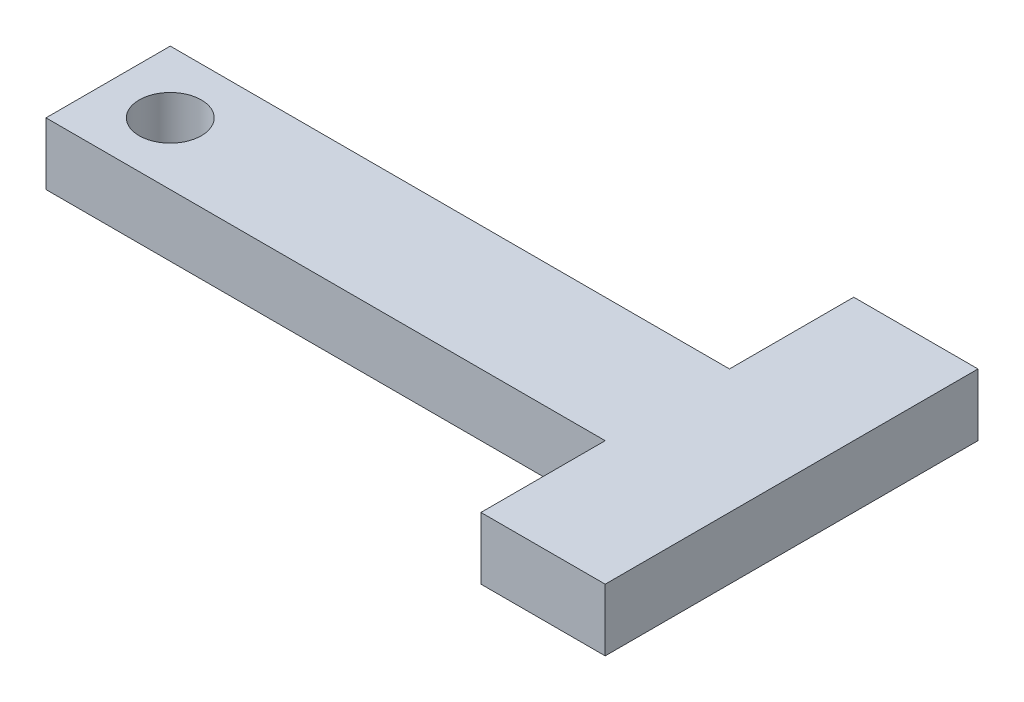
ISO-10303-21;
HEADER;
FILE_DESCRIPTION(('STEP AP214'),'2;1');
FILE_NAME('part.step','',(''),(''),'','','');
FILE_SCHEMA(('AUTOMOTIVE_DESIGN { 1 0 10303 214 1 1 1 1 }'));
ENDSEC;
DATA;
#1=APPLICATION_CONTEXT('core data for automotive mechanical design processes');
#2=APPLICATION_PROTOCOL_DEFINITION('international standard','automotive_design',2000,#1);
#3=PRODUCT_CONTEXT('',#1,'mechanical');
#4=PRODUCT('Part','Part','',(#3));
#5=PRODUCT_RELATED_PRODUCT_CATEGORY('part','',(#4));
#6=PRODUCT_DEFINITION_FORMATION('','',#4);
#7=PRODUCT_DEFINITION_CONTEXT('part definition',#1,'design');
#8=PRODUCT_DEFINITION('design','',#6,#7);
#9=PRODUCT_DEFINITION_SHAPE('','',#8);
#10=(LENGTH_UNIT() NAMED_UNIT(*) SI_UNIT(.MILLI.,.METRE.));
#11=(NAMED_UNIT(*) PLANE_ANGLE_UNIT() SI_UNIT($,.RADIAN.));
#12=(NAMED_UNIT(*) SI_UNIT($,.STERADIAN.) SOLID_ANGLE_UNIT());
#13=UNCERTAINTY_MEASURE_WITH_UNIT(LENGTH_MEASURE(1.E-05),#10,'distance_accuracy_value','');
#14=(GEOMETRIC_REPRESENTATION_CONTEXT(3) GLOBAL_UNCERTAINTY_ASSIGNED_CONTEXT((#13)) GLOBAL_UNIT_ASSIGNED_CONTEXT((#10,
#11,#12)) REPRESENTATION_CONTEXT('',''));
#15=CARTESIAN_POINT('',(0.,0.,0.));
#16=DIRECTION('',(0.,0.,1.));
#17=DIRECTION('',(1.,0.,0.));
#18=AXIS2_PLACEMENT_3D('',#15,#16,#17);
#19=CARTESIAN_POINT('',(0.,10.,0.));
#20=DIRECTION('',(0.,-1.,0.));
#21=DIRECTION('',(0.,0.,-1.));
#22=AXIS2_PLACEMENT_3D('',#19,#20,#21);
#23=PLANE('',#22);
#24=DIRECTION('',(0.,0.,1.));
#25=VECTOR('',#24,1.);
#26=CARTESIAN_POINT('',(0.,10.,0.));
#27=LINE('',#26,#25);
#28=CARTESIAN_POINT('',(0.,10.,-20.));
#29=VERTEX_POINT('',#28);
#30=CARTESIAN_POINT('',(0.,10.,0.));
#31=VERTEX_POINT('',#30);
#32=EDGE_CURVE('E145',#29,#31,#27,.T.);
#33=ORIENTED_EDGE('',*,*,#32,.T.);
#34=DIRECTION('',(1.,0.,0.));
#35=VECTOR('',#34,1.);
#36=CARTESIAN_POINT('',(0.,10.,0.));
#37=LINE('',#36,#35);
#38=CARTESIAN_POINT('',(90.,10.,0.));
#39=VERTEX_POINT('',#38);
#40=EDGE_CURVE('E93',#31,#39,#37,.T.);
#41=ORIENTED_EDGE('',*,*,#40,.T.);
#42=DIRECTION('',(0.,0.,1.));
#43=VECTOR('',#42,1.);
#44=CARTESIAN_POINT('',(90.,10.,20.));
#45=LINE('',#44,#43);
#46=CARTESIAN_POINT('',(90.,10.,20.));
#47=VERTEX_POINT('',#46);
#48=EDGE_CURVE('E160',#39,#47,#45,.T.);
#49=ORIENTED_EDGE('',*,*,#48,.T.);
#50=DIRECTION('',(1.,0.,0.));
#51=VECTOR('',#50,1.);
#52=CARTESIAN_POINT('',(110.,10.,20.));
#53=LINE('',#52,#51);
#54=CARTESIAN_POINT('',(110.,10.,20.));
#55=VERTEX_POINT('',#54);
#56=EDGE_CURVE('E173',#47,#55,#53,.T.);
#57=ORIENTED_EDGE('',*,*,#56,.T.);
#58=DIRECTION('',(0.,0.,-1.));
#59=VECTOR('',#58,1.);
#60=CARTESIAN_POINT('',(110.,10.,-40.));
#61=LINE('',#60,#59);
#62=CARTESIAN_POINT('',(110.,10.,-40.));
#63=VERTEX_POINT('',#62);
#64=EDGE_CURVE('E112',#55,#63,#61,.T.);
#65=ORIENTED_EDGE('',*,*,#64,.T.);
#66=DIRECTION('',(-1.,0.,0.));
#67=VECTOR('',#66,1.);
#68=CARTESIAN_POINT('',(90.,10.,-40.));
#69=LINE('',#68,#67);
#70=CARTESIAN_POINT('',(90.,10.,-40.));
#71=VERTEX_POINT('',#70);
#72=EDGE_CURVE('E106',#63,#71,#69,.T.);
#73=ORIENTED_EDGE('',*,*,#72,.T.);
#74=DIRECTION('',(0.,0.,1.));
#75=VECTOR('',#74,1.);
#76=CARTESIAN_POINT('',(90.,10.,-20.));
#77=LINE('',#76,#75);
#78=CARTESIAN_POINT('',(90.,10.,-20.));
#79=VERTEX_POINT('',#78);
#80=EDGE_CURVE('E110',#71,#79,#77,.T.);
#81=ORIENTED_EDGE('',*,*,#80,.T.);
#82=DIRECTION('',(-1.,0.,0.));
#83=VECTOR('',#82,1.);
#84=CARTESIAN_POINT('',(0.,10.,-20.));
#85=LINE('',#84,#83);
#86=EDGE_CURVE('E50',#79,#29,#85,.T.);
#87=ORIENTED_EDGE('',*,*,#86,.T.);
#88=EDGE_LOOP('',(#33,#41,#49,#57,#65,#73,#81,#87));
#89=FACE_BOUND('',#88,.T.);
#90=CARTESIAN_POINT('',(10.,10.,-10.));
#91=DIRECTION('',(0.,1.,0.));
#92=DIRECTION('',(0.,0.,1.));
#93=AXIS2_PLACEMENT_3D('',#90,#91,#92);
#94=CIRCLE('',#93,5.);
#95=CARTESIAN_POINT('',(10.,10.,-5.));
#96=VERTEX_POINT('',#95);
#97=EDGE_CURVE('E134',#96,#96,#94,.T.);
#98=ORIENTED_EDGE('',*,*,#97,.F.);
#99=EDGE_LOOP('',(#98));
#100=FACE_BOUND('',#99,.T.);
#101=ADVANCED_FACE('F33',(#89,#100),#23,.F.);
#102=CARTESIAN_POINT('',(0.,0.,0.));
#103=DIRECTION('',(0.,-1.,0.));
#104=DIRECTION('',(0.,0.,-1.));
#105=AXIS2_PLACEMENT_3D('',#102,#103,#104);
#106=PLANE('',#105);
#107=DIRECTION('',(0.,0.,1.));
#108=VECTOR('',#107,1.);
#109=CARTESIAN_POINT('',(0.,0.,0.));
#110=LINE('',#109,#108);
#111=CARTESIAN_POINT('',(0.,0.,-20.));
#112=VERTEX_POINT('',#111);
#113=CARTESIAN_POINT('',(0.,0.,0.));
#114=VERTEX_POINT('',#113);
#115=EDGE_CURVE('E130',#112,#114,#110,.T.);
#116=ORIENTED_EDGE('',*,*,#115,.F.);
#117=DIRECTION('',(-1.,0.,0.));
#118=VECTOR('',#117,1.);
#119=CARTESIAN_POINT('',(0.,0.,-20.));
#120=LINE('',#119,#118);
#121=CARTESIAN_POINT('',(90.,0.,-20.));
#122=VERTEX_POINT('',#121);
#123=EDGE_CURVE('E85',#122,#112,#120,.T.);
#124=ORIENTED_EDGE('',*,*,#123,.F.);
#125=DIRECTION('',(0.,0.,1.));
#126=VECTOR('',#125,1.);
#127=CARTESIAN_POINT('',(90.,0.,-20.));
#128=LINE('',#127,#126);
#129=CARTESIAN_POINT('',(90.,0.,-40.));
#130=VERTEX_POINT('',#129);
#131=EDGE_CURVE('E79',#130,#122,#128,.T.);
#132=ORIENTED_EDGE('',*,*,#131,.F.);
#133=DIRECTION('',(-1.,0.,0.));
#134=VECTOR('',#133,1.);
#135=CARTESIAN_POINT('',(90.,0.,-40.));
#136=LINE('',#135,#134);
#137=CARTESIAN_POINT('',(110.,0.,-40.));
#138=VERTEX_POINT('',#137);
#139=EDGE_CURVE('E120',#138,#130,#136,.T.);
#140=ORIENTED_EDGE('',*,*,#139,.F.);
#141=DIRECTION('',(0.,0.,-1.));
#142=VECTOR('',#141,1.);
#143=CARTESIAN_POINT('',(110.,0.,-40.));
#144=LINE('',#143,#142);
#145=CARTESIAN_POINT('',(110.,0.,20.));
#146=VERTEX_POINT('',#145);
#147=EDGE_CURVE('E140',#146,#138,#144,.T.);
#148=ORIENTED_EDGE('',*,*,#147,.F.);
#149=DIRECTION('',(1.,0.,0.));
#150=VECTOR('',#149,1.);
#151=CARTESIAN_POINT('',(110.,0.,20.));
#152=LINE('',#151,#150);
#153=CARTESIAN_POINT('',(90.,0.,20.));
#154=VERTEX_POINT('',#153);
#155=EDGE_CURVE('E138',#154,#146,#152,.T.);
#156=ORIENTED_EDGE('',*,*,#155,.F.);
#157=DIRECTION('',(0.,0.,1.));
#158=VECTOR('',#157,1.);
#159=CARTESIAN_POINT('',(90.,0.,20.));
#160=LINE('',#159,#158);
#161=CARTESIAN_POINT('',(90.,0.,0.));
#162=VERTEX_POINT('',#161);
#163=EDGE_CURVE('E136',#162,#154,#160,.T.);
#164=ORIENTED_EDGE('',*,*,#163,.F.);
#165=DIRECTION('',(1.,0.,0.));
#166=VECTOR('',#165,1.);
#167=CARTESIAN_POINT('',(0.,0.,0.));
#168=LINE('',#167,#166);
#169=EDGE_CURVE('E133',#114,#162,#168,.T.);
#170=ORIENTED_EDGE('',*,*,#169,.F.);
#171=EDGE_LOOP('',(#116,#124,#132,#140,#148,#156,#164,#170));
#172=FACE_BOUND('',#171,.T.);
#173=CARTESIAN_POINT('',(10.,0.,-10.));
#174=DIRECTION('',(0.,1.,0.));
#175=DIRECTION('',(0.,0.,1.));
#176=AXIS2_PLACEMENT_3D('',#173,#174,#175);
#177=CIRCLE('',#176,5.);
#178=CARTESIAN_POINT('',(10.,0.,-5.));
#179=VERTEX_POINT('',#178);
#180=EDGE_CURVE('E179',#179,#179,#177,.T.);
#181=ORIENTED_EDGE('',*,*,#180,.T.);
#182=EDGE_LOOP('',(#181));
#183=FACE_BOUND('',#182,.T.);
#184=ADVANCED_FACE('F164',(#172,#183),#106,.T.);
#185=CARTESIAN_POINT('',(0.,10.,0.));
#186=DIRECTION('',(1.,0.,0.));
#187=DIRECTION('',(0.,0.,-1.));
#188=AXIS2_PLACEMENT_3D('',#185,#186,#187);
#189=PLANE('',#188);
#190=ORIENTED_EDGE('',*,*,#115,.T.);
#191=DIRECTION('',(0.,-1.,0.));
#192=VECTOR('',#191,1.);
#193=CARTESIAN_POINT('',(0.,10.,0.));
#194=LINE('',#193,#192);
#195=EDGE_CURVE('E11',#31,#114,#194,.T.);
#196=ORIENTED_EDGE('',*,*,#195,.F.);
#197=ORIENTED_EDGE('',*,*,#32,.F.);
#198=DIRECTION('',(0.,-1.,0.));
#199=VECTOR('',#198,1.);
#200=CARTESIAN_POINT('',(0.,10.,-20.));
#201=LINE('',#200,#199);
#202=EDGE_CURVE('E126',#29,#112,#201,.T.);
#203=ORIENTED_EDGE('',*,*,#202,.T.);
#204=EDGE_LOOP('',(#190,#196,#197,#203));
#205=FACE_BOUND('',#204,.T.);
#206=ADVANCED_FACE('F35',(#205),#189,.F.);
#207=CARTESIAN_POINT('',(0.,10.,0.));
#208=DIRECTION('',(0.,0.,-1.));
#209=DIRECTION('',(-1.,0.,0.));
#210=AXIS2_PLACEMENT_3D('',#207,#208,#209);
#211=PLANE('',#210);
#212=ORIENTED_EDGE('',*,*,#169,.T.);
#213=DIRECTION('',(0.,-1.,0.));
#214=VECTOR('',#213,1.);
#215=CARTESIAN_POINT('',(90.,10.,0.));
#216=LINE('',#215,#214);
#217=EDGE_CURVE('E42',#39,#162,#216,.T.);
#218=ORIENTED_EDGE('',*,*,#217,.F.);
#219=ORIENTED_EDGE('',*,*,#40,.F.);
#220=ORIENTED_EDGE('',*,*,#195,.T.);
#221=EDGE_LOOP('',(#212,#218,#219,#220));
#222=FACE_BOUND('',#221,.T.);
#223=ADVANCED_FACE('F207',(#222),#211,.F.);
#224=CARTESIAN_POINT('',(90.,10.,20.));
#225=DIRECTION('',(1.,0.,0.));
#226=DIRECTION('',(0.,0.,-1.));
#227=AXIS2_PLACEMENT_3D('',#224,#225,#226);
#228=PLANE('',#227);
#229=ORIENTED_EDGE('',*,*,#163,.T.);
#230=DIRECTION('',(0.,-1.,0.));
#231=VECTOR('',#230,1.);
#232=CARTESIAN_POINT('',(90.,10.,20.));
#233=LINE('',#232,#231);
#234=EDGE_CURVE('E152',#47,#154,#233,.T.);
#235=ORIENTED_EDGE('',*,*,#234,.F.);
#236=ORIENTED_EDGE('',*,*,#48,.F.);
#237=ORIENTED_EDGE('',*,*,#217,.T.);
#238=EDGE_LOOP('',(#229,#235,#236,#237));
#239=FACE_BOUND('',#238,.T.);
#240=ADVANCED_FACE('F158',(#239),#228,.F.);
#241=CARTESIAN_POINT('',(110.,10.,20.));
#242=DIRECTION('',(0.,0.,-1.));
#243=DIRECTION('',(-1.,0.,0.));
#244=AXIS2_PLACEMENT_3D('',#241,#242,#243);
#245=PLANE('',#244);
#246=ORIENTED_EDGE('',*,*,#155,.T.);
#247=DIRECTION('',(0.,-1.,0.));
#248=VECTOR('',#247,1.);
#249=CARTESIAN_POINT('',(110.,10.,20.));
#250=LINE('',#249,#248);
#251=EDGE_CURVE('E149',#55,#146,#250,.T.);
#252=ORIENTED_EDGE('',*,*,#251,.F.);
#253=ORIENTED_EDGE('',*,*,#56,.F.);
#254=ORIENTED_EDGE('',*,*,#234,.T.);
#255=EDGE_LOOP('',(#246,#252,#253,#254));
#256=FACE_BOUND('',#255,.T.);
#257=ADVANCED_FACE('F169',(#256),#245,.F.);
#258=CARTESIAN_POINT('',(110.,10.,-40.));
#259=DIRECTION('',(-1.,0.,0.));
#260=DIRECTION('',(0.,0.,1.));
#261=AXIS2_PLACEMENT_3D('',#258,#259,#260);
#262=PLANE('',#261);
#263=ORIENTED_EDGE('',*,*,#147,.T.);
#264=DIRECTION('',(0.,-1.,0.));
#265=VECTOR('',#264,1.);
#266=CARTESIAN_POINT('',(110.,10.,-40.));
#267=LINE('',#266,#265);
#268=EDGE_CURVE('E121',#63,#138,#267,.T.);
#269=ORIENTED_EDGE('',*,*,#268,.F.);
#270=ORIENTED_EDGE('',*,*,#64,.F.);
#271=ORIENTED_EDGE('',*,*,#251,.T.);
#272=EDGE_LOOP('',(#263,#269,#270,#271));
#273=FACE_BOUND('',#272,.T.);
#274=ADVANCED_FACE('F172',(#273),#262,.F.);
#275=CARTESIAN_POINT('',(90.,10.,-40.));
#276=DIRECTION('',(0.,0.,1.));
#277=DIRECTION('',(1.,0.,0.));
#278=AXIS2_PLACEMENT_3D('',#275,#276,#277);
#279=PLANE('',#278);
#280=ORIENTED_EDGE('',*,*,#139,.T.);
#281=DIRECTION('',(0.,-1.,0.));
#282=VECTOR('',#281,1.);
#283=CARTESIAN_POINT('',(90.,10.,-40.));
#284=LINE('',#283,#282);
#285=EDGE_CURVE('E117',#71,#130,#284,.T.);
#286=ORIENTED_EDGE('',*,*,#285,.F.);
#287=ORIENTED_EDGE('',*,*,#72,.F.);
#288=ORIENTED_EDGE('',*,*,#268,.T.);
#289=EDGE_LOOP('',(#280,#286,#287,#288));
#290=FACE_BOUND('',#289,.T.);
#291=ADVANCED_FACE('F118',(#290),#279,.F.);
#292=CARTESIAN_POINT('',(90.,10.,-20.));
#293=DIRECTION('',(1.,0.,0.));
#294=DIRECTION('',(0.,0.,-1.));
#295=AXIS2_PLACEMENT_3D('',#292,#293,#294);
#296=PLANE('',#295);
#297=ORIENTED_EDGE('',*,*,#131,.T.);
#298=DIRECTION('',(0.,-1.,0.));
#299=VECTOR('',#298,1.);
#300=CARTESIAN_POINT('',(90.,10.,-20.));
#301=LINE('',#300,#299);
#302=EDGE_CURVE('E122',#79,#122,#301,.T.);
#303=ORIENTED_EDGE('',*,*,#302,.F.);
#304=ORIENTED_EDGE('',*,*,#80,.F.);
#305=ORIENTED_EDGE('',*,*,#285,.T.);
#306=EDGE_LOOP('',(#297,#303,#304,#305));
#307=FACE_BOUND('',#306,.T.);
#308=ADVANCED_FACE('F124',(#307),#296,.F.);
#309=CARTESIAN_POINT('',(0.,10.,-20.));
#310=DIRECTION('',(0.,0.,1.));
#311=DIRECTION('',(1.,0.,0.));
#312=AXIS2_PLACEMENT_3D('',#309,#310,#311);
#313=PLANE('',#312);
#314=ORIENTED_EDGE('',*,*,#123,.T.);
#315=ORIENTED_EDGE('',*,*,#202,.F.);
#316=ORIENTED_EDGE('',*,*,#86,.F.);
#317=ORIENTED_EDGE('',*,*,#302,.T.);
#318=EDGE_LOOP('',(#314,#315,#316,#317));
#319=FACE_BOUND('',#318,.T.);
#320=ADVANCED_FACE('F195',(#319),#313,.F.);
#321=CARTESIAN_POINT('',(10.,10.,-10.));
#322=DIRECTION('',(0.,-1.,0.));
#323=DIRECTION('',(0.,0.,-1.));
#324=AXIS2_PLACEMENT_3D('',#321,#322,#323);
#325=CYLINDRICAL_SURFACE('',#324,5.);
#326=ORIENTED_EDGE('',*,*,#97,.T.);
#327=EDGE_LOOP('',(#326));
#328=FACE_BOUND('',#327,.T.);
#329=ORIENTED_EDGE('',*,*,#180,.F.);
#330=EDGE_LOOP('',(#329));
#331=FACE_BOUND('',#330,.T.);
#332=ADVANCED_FACE('F185',(#328,#331),#325,.F.);
#333=CLOSED_SHELL('',(#101,#184,#206,#223,#240,#257,#274,#291,#308,#320,#332));
#334=MANIFOLD_SOLID_BREP('B2',#333);
#335=ADVANCED_BREP_SHAPE_REPRESENTATION('',(#18,#334),#14);
#336=SHAPE_DEFINITION_REPRESENTATION(#9,#335);
ENDSEC;
END-ISO-10303-21;
